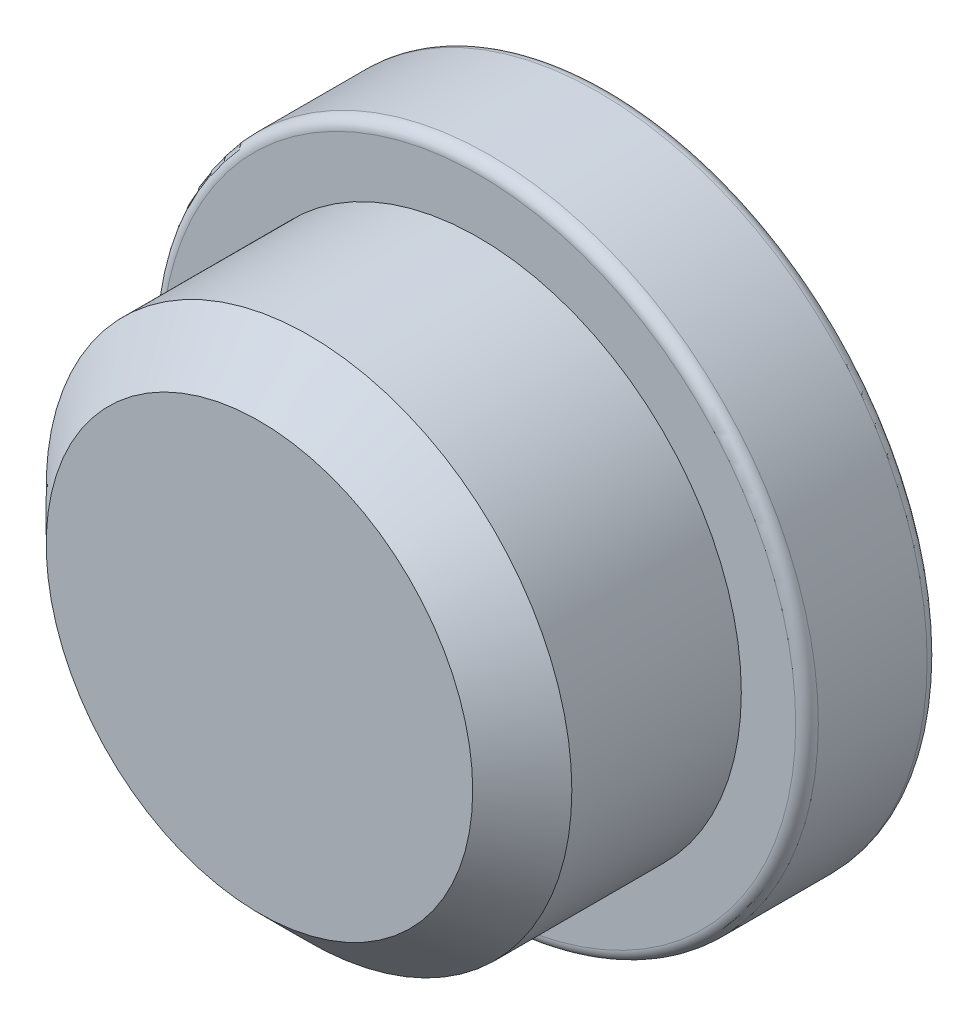
ISO-10303-21;
HEADER;
FILE_DESCRIPTION(('STEP AP214'),'2;1');
FILE_NAME('part.step','',(''),(''),'','','');
FILE_SCHEMA(('AUTOMOTIVE_DESIGN { 1 0 10303 214 1 1 1 1 }'));
ENDSEC;
DATA;
#1=APPLICATION_CONTEXT('core data for automotive mechanical design processes');
#2=APPLICATION_PROTOCOL_DEFINITION('international standard','automotive_design',2000,#1);
#3=PRODUCT_CONTEXT('',#1,'mechanical');
#4=PRODUCT('Part','Part','',(#3));
#5=PRODUCT_RELATED_PRODUCT_CATEGORY('part','',(#4));
#6=PRODUCT_DEFINITION_FORMATION('','',#4);
#7=PRODUCT_DEFINITION_CONTEXT('part definition',#1,'design');
#8=PRODUCT_DEFINITION('design','',#6,#7);
#9=PRODUCT_DEFINITION_SHAPE('','',#8);
#10=(LENGTH_UNIT() NAMED_UNIT(*) SI_UNIT(.MILLI.,.METRE.));
#11=(NAMED_UNIT(*) PLANE_ANGLE_UNIT() SI_UNIT($,.RADIAN.));
#12=(NAMED_UNIT(*) SI_UNIT($,.STERADIAN.) SOLID_ANGLE_UNIT());
#13=UNCERTAINTY_MEASURE_WITH_UNIT(LENGTH_MEASURE(1.E-05),#10,'distance_accuracy_value','');
#14=(GEOMETRIC_REPRESENTATION_CONTEXT(3) GLOBAL_UNCERTAINTY_ASSIGNED_CONTEXT((#13)) GLOBAL_UNIT_ASSIGNED_CONTEXT((#10,
#11,#12)) REPRESENTATION_CONTEXT('',''));
#15=CARTESIAN_POINT('',(0.,0.,0.));
#16=DIRECTION('',(0.,0.,1.));
#17=DIRECTION('',(1.,0.,0.));
#18=AXIS2_PLACEMENT_3D('',#15,#16,#17);
#19=CARTESIAN_POINT('',(0.,0.,-6.35));
#20=DIRECTION('',(0.,0.,-1.));
#21=DIRECTION('',(-1.,0.,0.));
#22=AXIS2_PLACEMENT_3D('',#19,#20,#21);
#23=PLANE('',#22);
#24=DIRECTION('',(0.,-1.,0.));
#25=VECTOR('',#24,1.);
#26=CARTESIAN_POINT('',(0.79375,-4.7625,-6.35));
#27=LINE('',#26,#25);
#28=CARTESIAN_POINT('',(0.79375,4.07509233574608,-6.35));
#29=VERTEX_POINT('',#28);
#30=CARTESIAN_POINT('',(0.79375,-4.07509233574608,-6.35));
#31=VERTEX_POINT('',#30);
#32=EDGE_CURVE('E101',#29,#31,#27,.T.);
#33=ORIENTED_EDGE('',*,*,#32,.F.);
#34=DIRECTION('',(-1.,0.,0.));
#35=VECTOR('',#34,1.);
#36=CARTESIAN_POINT('',(0.79375,4.07509233574608,-6.35));
#37=LINE('',#36,#35);
#38=CARTESIAN_POINT('',(-0.79375,4.07509233574607,-6.34999999999999));
#39=VERTEX_POINT('',#38);
#40=EDGE_CURVE('E11',#29,#39,#37,.T.);
#41=ORIENTED_EDGE('',*,*,#40,.T.);
#42=DIRECTION('',(0.,1.,0.));
#43=VECTOR('',#42,1.);
#44=CARTESIAN_POINT('',(-0.79375,-4.7625,-6.35));
#45=LINE('',#44,#43);
#46=CARTESIAN_POINT('',(-0.79375,-4.07509233574608,-6.35));
#47=VERTEX_POINT('',#46);
#48=EDGE_CURVE('E97',#47,#39,#45,.T.);
#49=ORIENTED_EDGE('',*,*,#48,.F.);
#50=DIRECTION('',(1.,0.,0.));
#51=VECTOR('',#50,1.);
#52=CARTESIAN_POINT('',(0.79375,-4.07509233574608,-6.35));
#53=LINE('',#52,#51);
#54=EDGE_CURVE('E43',#47,#31,#53,.T.);
#55=ORIENTED_EDGE('',*,*,#54,.T.);
#56=EDGE_LOOP('',(#33,#41,#49,#55));
#57=FACE_BOUND('',#56,.T.);
#58=CARTESIAN_POINT('',(0.,0.,-6.35));
#59=DIRECTION('',(0.,0.,-1.));
#60=DIRECTION('',(-1.,0.,0.));
#61=AXIS2_PLACEMENT_3D('',#58,#59,#60);
#62=CIRCLE('',#61,5.74828629032258);
#63=CARTESIAN_POINT('',(-5.74828629032258,0.,-6.35));
#64=VERTEX_POINT('',#63);
#65=EDGE_CURVE('E93',#64,#64,#62,.T.);
#66=ORIENTED_EDGE('',*,*,#65,.T.);
#67=EDGE_LOOP('',(#66));
#68=FACE_BOUND('',#67,.T.);
#69=ADVANCED_FACE('F34',(#57,#68),#23,.T.);
#70=CARTESIAN_POINT('',(0.,0.,0.));
#71=DIRECTION('',(0.,0.,1.));
#72=DIRECTION('',(1.,0.,0.));
#73=AXIS2_PLACEMENT_3D('',#70,#71,#72);
#74=CYLINDRICAL_SURFACE('',#73,5.953125);
#75=CARTESIAN_POINT('',(0.,0.,-4.17358870967742));
#76=DIRECTION('',(0.,0.,1.));
#77=DIRECTION('',(1.,0.,0.));
#78=AXIS2_PLACEMENT_3D('',#75,#76,#77);
#79=CIRCLE('',#78,5.953125);
#80=CARTESIAN_POINT('',(5.953125,0.,-4.17358870967742));
#81=VERTEX_POINT('',#80);
#82=EDGE_CURVE('E119',#81,#81,#79,.F.);
#83=ORIENTED_EDGE('',*,*,#82,.T.);
#84=EDGE_LOOP('',(#83));
#85=FACE_BOUND('',#84,.T.);
#86=CARTESIAN_POINT('',(0.,0.,-6.14516129032258));
#87=DIRECTION('',(0.,0.,-1.));
#88=DIRECTION('',(-1.,0.,0.));
#89=AXIS2_PLACEMENT_3D('',#86,#87,#88);
#90=CIRCLE('',#89,5.953125);
#91=CARTESIAN_POINT('',(-5.953125,0.,-6.14516129032258));
#92=VERTEX_POINT('',#91);
#93=EDGE_CURVE('E116',#92,#92,#90,.F.);
#94=ORIENTED_EDGE('',*,*,#93,.T.);
#95=EDGE_LOOP('',(#94));
#96=FACE_BOUND('',#95,.T.);
#97=ADVANCED_FACE('F140',(#85,#96),#74,.T.);
#98=CARTESIAN_POINT('',(5.953125,0.,-3.96875));
#99=DIRECTION('',(0.,0.,1.));
#100=DIRECTION('',(1.,0.,0.));
#101=AXIS2_PLACEMENT_3D('',#98,#99,#100);
#102=PLANE('',#101);
#103=CARTESIAN_POINT('',(0.,0.,-3.96875));
#104=DIRECTION('',(0.,0.,1.));
#105=DIRECTION('',(1.,0.,0.));
#106=AXIS2_PLACEMENT_3D('',#103,#104,#105);
#107=CIRCLE('',#106,5.74828629032258);
#108=CARTESIAN_POINT('',(5.74828629032258,0.,-3.96875));
#109=VERTEX_POINT('',#108);
#110=EDGE_CURVE('E113',#109,#109,#107,.T.);
#111=ORIENTED_EDGE('',*,*,#110,.T.);
#112=EDGE_LOOP('',(#111));
#113=FACE_BOUND('',#112,.T.);
#114=CARTESIAN_POINT('',(0.,0.,-3.96875));
#115=DIRECTION('',(0.,0.,1.));
#116=DIRECTION('',(1.,0.,0.));
#117=AXIS2_PLACEMENT_3D('',#114,#115,#116);
#118=CIRCLE('',#117,4.7625);
#119=CARTESIAN_POINT('',(4.7625,0.,-3.96875));
#120=VERTEX_POINT('',#119);
#121=EDGE_CURVE('E110',#120,#120,#118,.T.);
#122=ORIENTED_EDGE('',*,*,#121,.F.);
#123=EDGE_LOOP('',(#122));
#124=FACE_BOUND('',#123,.T.);
#125=ADVANCED_FACE('F145',(#113,#124),#102,.T.);
#126=CARTESIAN_POINT('',(0.,0.,0.));
#127=DIRECTION('',(0.,0.,1.));
#128=DIRECTION('',(1.,0.,0.));
#129=AXIS2_PLACEMENT_3D('',#126,#127,#128);
#130=CYLINDRICAL_SURFACE('',#129,4.7625);
#131=ORIENTED_EDGE('',*,*,#121,.T.);
#132=EDGE_LOOP('',(#131));
#133=FACE_BOUND('',#132,.T.);
#134=CARTESIAN_POINT('',(0.,0.,-0.898025612106917));
#135=DIRECTION('',(0.,0.,1.));
#136=DIRECTION('',(1.,0.,0.));
#137=AXIS2_PLACEMENT_3D('',#134,#135,#136);
#138=CIRCLE('',#137,4.7625);
#139=CARTESIAN_POINT('',(4.7625,0.,-0.898025612106917));
#140=VERTEX_POINT('',#139);
#141=EDGE_CURVE('E107',#140,#140,#138,.T.);
#142=ORIENTED_EDGE('',*,*,#141,.F.);
#143=EDGE_LOOP('',(#142));
#144=FACE_BOUND('',#143,.T.);
#145=ADVANCED_FACE('F212',(#133,#144),#130,.T.);
#146=CARTESIAN_POINT('',(0.,0.,0.));
#147=DIRECTION('',(0.,0.,-1.));
#148=DIRECTION('',(-1.,0.,0.));
#149=AXIS2_PLACEMENT_3D('',#146,#147,#148);
#150=CONICAL_SURFACE('',#149,3.86447438789309,0.785398163397447);
#151=ORIENTED_EDGE('',*,*,#141,.T.);
#152=EDGE_LOOP('',(#151));
#153=FACE_BOUND('',#152,.T.);
#154=CARTESIAN_POINT('',(0.,0.,0.));
#155=DIRECTION('',(0.,0.,1.));
#156=DIRECTION('',(1.,0.,0.));
#157=AXIS2_PLACEMENT_3D('',#154,#155,#156);
#158=CIRCLE('',#157,3.86447438789309);
#159=CARTESIAN_POINT('',(3.86447438789309,0.,0.));
#160=VERTEX_POINT('',#159);
#161=EDGE_CURVE('E99',#160,#160,#158,.T.);
#162=ORIENTED_EDGE('',*,*,#161,.F.);
#163=EDGE_LOOP('',(#162));
#164=FACE_BOUND('',#163,.T.);
#165=ADVANCED_FACE('F226',(#153,#164),#150,.T.);
#166=CARTESIAN_POINT('',(3.86447438789309,0.,0.));
#167=DIRECTION('',(0.,0.,1.));
#168=DIRECTION('',(1.,0.,0.));
#169=AXIS2_PLACEMENT_3D('',#166,#167,#168);
#170=PLANE('',#169);
#171=ORIENTED_EDGE('',*,*,#161,.T.);
#172=EDGE_LOOP('',(#171));
#173=FACE_BOUND('',#172,.T.);
#174=ADVANCED_FACE('F154',(#173),#170,.T.);
#175=CARTESIAN_POINT('',(0.,0.,-4.17358870967742));
#176=DIRECTION('',(0.,0.,1.));
#177=DIRECTION('',(1.,0.,0.));
#178=AXIS2_PLACEMENT_3D('',#175,#176,#177);
#179=TOROIDAL_SURFACE('',#178,5.74828629032258,0.204838709677419);
#180=ORIENTED_EDGE('',*,*,#82,.F.);
#181=EDGE_LOOP('',(#180));
#182=FACE_BOUND('',#181,.T.);
#183=ORIENTED_EDGE('',*,*,#110,.F.);
#184=EDGE_LOOP('',(#183));
#185=FACE_BOUND('',#184,.T.);
#186=ADVANCED_FACE('F151',(#182,#185),#179,.T.);
#187=CARTESIAN_POINT('',(0.,0.,-6.14516129032258));
#188=DIRECTION('',(0.,0.,-1.));
#189=DIRECTION('',(-1.,0.,0.));
#190=AXIS2_PLACEMENT_3D('',#187,#188,#189);
#191=TOROIDAL_SURFACE('',#190,5.74828629032258,0.204838709677419);
#192=ORIENTED_EDGE('',*,*,#65,.F.);
#193=EDGE_LOOP('',(#192));
#194=FACE_BOUND('',#193,.T.);
#195=ORIENTED_EDGE('',*,*,#93,.F.);
#196=EDGE_LOOP('',(#195));
#197=FACE_BOUND('',#196,.T.);
#198=ADVANCED_FACE('F137',(#194,#197),#191,.T.);
#199=CARTESIAN_POINT('',(0.79375,-4.7625,-5.953125));
#200=DIRECTION('',(1.,0.,0.));
#201=DIRECTION('',(0.,1.,0.));
#202=AXIS2_PLACEMENT_3D('',#199,#200,#201);
#203=PLANE('',#202);
#204=ORIENTED_EDGE('',*,*,#32,.T.);
#205=DIRECTION('',(0.,0.86602540378444,0.499999999999997));
#206=VECTOR('',#205,1.);
#207=CARTESIAN_POINT('',(0.79375,-3.38768467149217,-5.953125));
#208=LINE('',#207,#206);
#209=CARTESIAN_POINT('',(0.79375,-3.38768467149217,-5.953125));
#210=VERTEX_POINT('',#209);
#211=EDGE_CURVE('E83',#31,#210,#208,.T.);
#212=ORIENTED_EDGE('',*,*,#211,.T.);
#213=DIRECTION('',(0.,-1.,0.));
#214=VECTOR('',#213,1.);
#215=CARTESIAN_POINT('',(0.79375,-4.7625,-5.953125));
#216=LINE('',#215,#214);
#217=CARTESIAN_POINT('',(0.79375,3.38768467149216,-5.95312499999999));
#218=VERTEX_POINT('',#217);
#219=EDGE_CURVE('E89',#218,#210,#216,.T.);
#220=ORIENTED_EDGE('',*,*,#219,.F.);
#221=DIRECTION('',(0.,0.866025403784441,-0.499999999999997));
#222=VECTOR('',#221,1.);
#223=CARTESIAN_POINT('',(0.79375,3.38768467149218,-5.953125));
#224=LINE('',#223,#222);
#225=EDGE_CURVE('E78',#218,#29,#224,.T.);
#226=ORIENTED_EDGE('',*,*,#225,.T.);
#227=EDGE_LOOP('',(#204,#212,#220,#226));
#228=FACE_BOUND('',#227,.T.);
#229=ADVANCED_FACE('F95',(#228),#203,.F.);
#230=CARTESIAN_POINT('',(-0.79375,-4.7625,-5.953125));
#231=DIRECTION('',(-1.,0.,0.));
#232=DIRECTION('',(0.,0.,1.));
#233=AXIS2_PLACEMENT_3D('',#230,#231,#232);
#234=PLANE('',#233);
#235=DIRECTION('',(0.,1.,0.));
#236=VECTOR('',#235,1.);
#237=CARTESIAN_POINT('',(-0.79375,-4.7625,-5.953125));
#238=LINE('',#237,#236);
#239=CARTESIAN_POINT('',(-0.79375,-3.38768467149217,-5.953125));
#240=VERTEX_POINT('',#239);
#241=CARTESIAN_POINT('',(-0.79375,3.38768467149216,-5.95312499999999));
#242=VERTEX_POINT('',#241);
#243=EDGE_CURVE('E91',#240,#242,#238,.T.);
#244=ORIENTED_EDGE('',*,*,#243,.F.);
#245=DIRECTION('',(0.,-0.86602540378444,-0.499999999999997));
#246=VECTOR('',#245,1.);
#247=CARTESIAN_POINT('',(-0.79375,-3.38768467149217,-5.953125));
#248=LINE('',#247,#246);
#249=EDGE_CURVE('E62',#240,#47,#248,.T.);
#250=ORIENTED_EDGE('',*,*,#249,.T.);
#251=ORIENTED_EDGE('',*,*,#48,.T.);
#252=DIRECTION('',(0.,-0.866025403784441,0.499999999999997));
#253=VECTOR('',#252,1.);
#254=CARTESIAN_POINT('',(-0.79375,3.38768467149218,-5.953125));
#255=LINE('',#254,#253);
#256=EDGE_CURVE('E66',#39,#242,#255,.T.);
#257=ORIENTED_EDGE('',*,*,#256,.T.);
#258=EDGE_LOOP('',(#244,#250,#251,#257));
#259=FACE_BOUND('',#258,.T.);
#260=ADVANCED_FACE('F128',(#259),#234,.F.);
#261=CARTESIAN_POINT('',(0.79375,4.7625,-5.953125));
#262=DIRECTION('',(0.,0.,-1.));
#263=DIRECTION('',(-1.,0.,0.));
#264=AXIS2_PLACEMENT_3D('',#261,#262,#263);
#265=PLANE('',#264);
#266=ORIENTED_EDGE('',*,*,#219,.T.);
#267=DIRECTION('',(-1.,0.,0.));
#268=VECTOR('',#267,1.);
#269=CARTESIAN_POINT('',(0.79375,-3.38768467149217,-5.953125));
#270=LINE('',#269,#268);
#271=EDGE_CURVE('E92',#210,#240,#270,.T.);
#272=ORIENTED_EDGE('',*,*,#271,.T.);
#273=ORIENTED_EDGE('',*,*,#243,.T.);
#274=DIRECTION('',(1.,0.,0.));
#275=VECTOR('',#274,1.);
#276=CARTESIAN_POINT('',(0.79375,3.38768467149218,-5.953125));
#277=LINE('',#276,#275);
#278=EDGE_CURVE('E80',#242,#218,#277,.T.);
#279=ORIENTED_EDGE('',*,*,#278,.T.);
#280=EDGE_LOOP('',(#266,#272,#273,#279));
#281=FACE_BOUND('',#280,.T.);
#282=ADVANCED_FACE('F87',(#281),#265,.T.);
#283=CARTESIAN_POINT('',(0.79375,-3.38768467149217,-5.953125));
#284=DIRECTION('',(0.,-0.499999999999997,0.86602540378444));
#285=DIRECTION('',(0.,-0.86602540378444,-0.499999999999997));
#286=AXIS2_PLACEMENT_3D('',#283,#284,#285);
#287=PLANE('',#286);
#288=ORIENTED_EDGE('',*,*,#211,.F.);
#289=ORIENTED_EDGE('',*,*,#54,.F.);
#290=ORIENTED_EDGE('',*,*,#249,.F.);
#291=ORIENTED_EDGE('',*,*,#271,.F.);
#292=EDGE_LOOP('',(#288,#289,#290,#291));
#293=FACE_BOUND('',#292,.T.);
#294=ADVANCED_FACE('F135',(#293),#287,.F.);
#295=CARTESIAN_POINT('',(0.79375,3.38768467149218,-5.953125));
#296=DIRECTION('',(0.,0.499999999999997,0.866025403784441));
#297=DIRECTION('',(0.,-0.866025403784441,0.499999999999997));
#298=AXIS2_PLACEMENT_3D('',#295,#296,#297);
#299=PLANE('',#298);
#300=ORIENTED_EDGE('',*,*,#256,.F.);
#301=ORIENTED_EDGE('',*,*,#40,.F.);
#302=ORIENTED_EDGE('',*,*,#225,.F.);
#303=ORIENTED_EDGE('',*,*,#278,.F.);
#304=EDGE_LOOP('',(#300,#301,#302,#303));
#305=FACE_BOUND('',#304,.T.);
#306=ADVANCED_FACE('F36',(#305),#299,.F.);
#307=CLOSED_SHELL('',(#69,#97,#125,#145,#165,#174,#186,#198,#229,#260,#282,#294,#306));
#308=MANIFOLD_SOLID_BREP('B2',#307);
#309=ADVANCED_BREP_SHAPE_REPRESENTATION('',(#18,#308),#14);
#310=SHAPE_DEFINITION_REPRESENTATION(#9,#309);
ENDSEC;
END-ISO-10303-21;
